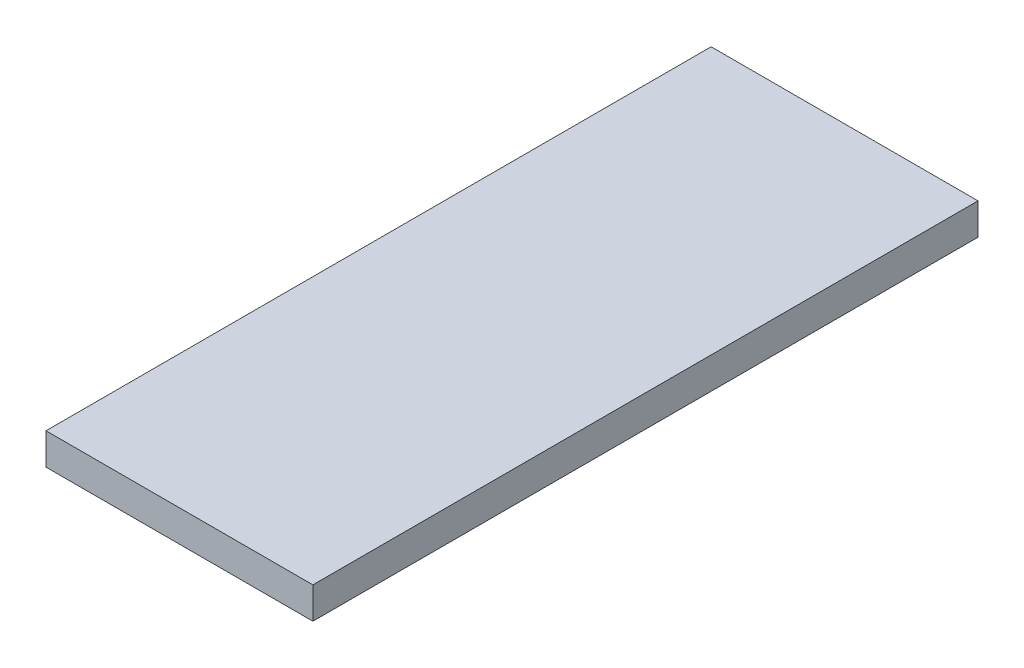
ISO-10303-21;
HEADER;
FILE_DESCRIPTION(('STEP AP214'),'2;1');
FILE_NAME('part.step','',(''),(''),'','','');
FILE_SCHEMA(('AUTOMOTIVE_DESIGN { 1 0 10303 214 1 1 1 1 }'));
ENDSEC;
DATA;
#1=APPLICATION_CONTEXT('core data for automotive mechanical design processes');
#2=APPLICATION_PROTOCOL_DEFINITION('international standard','automotive_design',2000,#1);
#3=PRODUCT_CONTEXT('',#1,'mechanical');
#4=PRODUCT('Part','Part','',(#3));
#5=PRODUCT_RELATED_PRODUCT_CATEGORY('part','',(#4));
#6=PRODUCT_DEFINITION_FORMATION('','',#4);
#7=PRODUCT_DEFINITION_CONTEXT('part definition',#1,'design');
#8=PRODUCT_DEFINITION('design','',#6,#7);
#9=PRODUCT_DEFINITION_SHAPE('','',#8);
#10=(LENGTH_UNIT() NAMED_UNIT(*) SI_UNIT(.MILLI.,.METRE.));
#11=(NAMED_UNIT(*) PLANE_ANGLE_UNIT() SI_UNIT($,.RADIAN.));
#12=(NAMED_UNIT(*) SI_UNIT($,.STERADIAN.) SOLID_ANGLE_UNIT());
#13=UNCERTAINTY_MEASURE_WITH_UNIT(LENGTH_MEASURE(1.E-05),#10,'distance_accuracy_value','');
#14=(GEOMETRIC_REPRESENTATION_CONTEXT(3) GLOBAL_UNCERTAINTY_ASSIGNED_CONTEXT((#13)) GLOBAL_UNIT_ASSIGNED_CONTEXT((#10,
#11,#12)) REPRESENTATION_CONTEXT('',''));
#15=CARTESIAN_POINT('',(0.,0.,0.));
#16=DIRECTION('',(0.,0.,1.));
#17=DIRECTION('',(1.,0.,0.));
#18=AXIS2_PLACEMENT_3D('',#15,#16,#17);
#19=CARTESIAN_POINT('',(12.7,3.,-31.6499999999998));
#20=DIRECTION('',(-1.,0.,0.));
#21=DIRECTION('',(0.,0.,1.));
#22=AXIS2_PLACEMENT_3D('',#19,#20,#21);
#23=PLANE('',#22);
#24=DIRECTION('',(0.,0.,-1.));
#25=VECTOR('',#24,1.);
#26=CARTESIAN_POINT('',(12.7,0.,-31.6499999999998));
#27=LINE('',#26,#25);
#28=CARTESIAN_POINT('',(12.7,0.,31.6500000000002));
#29=VERTEX_POINT('',#28);
#30=CARTESIAN_POINT('',(12.7,0.,-31.6499999999998));
#31=VERTEX_POINT('',#30);
#32=EDGE_CURVE('E113',#29,#31,#27,.T.);
#33=ORIENTED_EDGE('',*,*,#32,.T.);
#34=DIRECTION('',(0.,-1.,0.));
#35=VECTOR('',#34,1.);
#36=CARTESIAN_POINT('',(12.7,3.,-31.6499999999998));
#37=LINE('',#36,#35);
#38=CARTESIAN_POINT('',(12.7,3.,-31.6499999999998));
#39=VERTEX_POINT('',#38);
#40=EDGE_CURVE('E11',#39,#31,#37,.T.);
#41=ORIENTED_EDGE('',*,*,#40,.F.);
#42=DIRECTION('',(0.,0.,-1.));
#43=VECTOR('',#42,1.);
#44=CARTESIAN_POINT('',(12.7,3.,-31.6499999999998));
#45=LINE('',#44,#43);
#46=CARTESIAN_POINT('',(12.7,3.,31.6500000000002));
#47=VERTEX_POINT('',#46);
#48=EDGE_CURVE('E97',#47,#39,#45,.T.);
#49=ORIENTED_EDGE('',*,*,#48,.F.);
#50=DIRECTION('',(0.,-1.,0.));
#51=VECTOR('',#50,1.);
#52=CARTESIAN_POINT('',(12.7,3.,31.6500000000002));
#53=LINE('',#52,#51);
#54=EDGE_CURVE('E109',#47,#29,#53,.T.);
#55=ORIENTED_EDGE('',*,*,#54,.T.);
#56=EDGE_LOOP('',(#33,#41,#49,#55));
#57=FACE_BOUND('',#56,.T.);
#58=ADVANCED_FACE('F45',(#57),#23,.F.);
#59=CARTESIAN_POINT('',(-12.6999999999999,3.,-31.6499999999998));
#60=DIRECTION('',(0.,0.,1.));
#61=DIRECTION('',(1.,0.,0.));
#62=AXIS2_PLACEMENT_3D('',#59,#60,#61);
#63=PLANE('',#62);
#64=DIRECTION('',(-1.,0.,0.));
#65=VECTOR('',#64,1.);
#66=CARTESIAN_POINT('',(-12.6999999999999,0.,-31.6499999999998));
#67=LINE('',#66,#65);
#68=CARTESIAN_POINT('',(-12.6999999999999,0.,-31.6499999999998));
#69=VERTEX_POINT('',#68);
#70=EDGE_CURVE('E102',#31,#69,#67,.T.);
#71=ORIENTED_EDGE('',*,*,#70,.T.);
#72=DIRECTION('',(0.,-1.,0.));
#73=VECTOR('',#72,1.);
#74=CARTESIAN_POINT('',(-12.6999999999999,3.,-31.6499999999998));
#75=LINE('',#74,#73);
#76=CARTESIAN_POINT('',(-12.6999999999999,3.,-31.6499999999998));
#77=VERTEX_POINT('',#76);
#78=EDGE_CURVE('E54',#77,#69,#75,.T.);
#79=ORIENTED_EDGE('',*,*,#78,.F.);
#80=DIRECTION('',(-1.,0.,0.));
#81=VECTOR('',#80,1.);
#82=CARTESIAN_POINT('',(-12.6999999999999,3.,-31.6499999999998));
#83=LINE('',#82,#81);
#84=EDGE_CURVE('E92',#39,#77,#83,.T.);
#85=ORIENTED_EDGE('',*,*,#84,.F.);
#86=ORIENTED_EDGE('',*,*,#40,.T.);
#87=EDGE_LOOP('',(#71,#79,#85,#86));
#88=FACE_BOUND('',#87,.T.);
#89=ADVANCED_FACE('F101',(#88),#63,.F.);
#90=CARTESIAN_POINT('',(-12.6999999999999,3.,-31.6499999999998));
#91=DIRECTION('',(1.,0.,0.));
#92=DIRECTION('',(0.,0.,-1.));
#93=AXIS2_PLACEMENT_3D('',#90,#91,#92);
#94=PLANE('',#93);
#95=DIRECTION('',(0.,0.,1.));
#96=VECTOR('',#95,1.);
#97=CARTESIAN_POINT('',(-12.6999999999999,0.,-31.6499999999998));
#98=LINE('',#97,#96);
#99=CARTESIAN_POINT('',(-12.7,0.,31.6500000000002));
#100=VERTEX_POINT('',#99);
#101=EDGE_CURVE('E79',#69,#100,#98,.T.);
#102=ORIENTED_EDGE('',*,*,#101,.T.);
#103=DIRECTION('',(0.,-1.,0.));
#104=VECTOR('',#103,1.);
#105=CARTESIAN_POINT('',(-12.7,3.,31.6500000000002));
#106=LINE('',#105,#104);
#107=CARTESIAN_POINT('',(-12.7,3.,31.6500000000002));
#108=VERTEX_POINT('',#107);
#109=EDGE_CURVE('E104',#108,#100,#106,.T.);
#110=ORIENTED_EDGE('',*,*,#109,.F.);
#111=DIRECTION('',(0.,0.,1.));
#112=VECTOR('',#111,1.);
#113=CARTESIAN_POINT('',(-12.6999999999999,3.,-31.6499999999998));
#114=LINE('',#113,#112);
#115=EDGE_CURVE('E95',#77,#108,#114,.T.);
#116=ORIENTED_EDGE('',*,*,#115,.F.);
#117=ORIENTED_EDGE('',*,*,#78,.T.);
#118=EDGE_LOOP('',(#102,#110,#116,#117));
#119=FACE_BOUND('',#118,.T.);
#120=ADVANCED_FACE('F105',(#119),#94,.F.);
#121=CARTESIAN_POINT('',(-12.7,3.,31.6500000000002));
#122=DIRECTION('',(0.,0.,-1.));
#123=DIRECTION('',(-1.,0.,0.));
#124=AXIS2_PLACEMENT_3D('',#121,#122,#123);
#125=PLANE('',#124);
#126=DIRECTION('',(1.,0.,0.));
#127=VECTOR('',#126,1.);
#128=CARTESIAN_POINT('',(-12.7,0.,31.6500000000002));
#129=LINE('',#128,#127);
#130=EDGE_CURVE('E85',#100,#29,#129,.T.);
#131=ORIENTED_EDGE('',*,*,#130,.T.);
#132=ORIENTED_EDGE('',*,*,#54,.F.);
#133=DIRECTION('',(1.,0.,0.));
#134=VECTOR('',#133,1.);
#135=CARTESIAN_POINT('',(-12.7,3.,31.6500000000002));
#136=LINE('',#135,#134);
#137=EDGE_CURVE('E62',#108,#47,#136,.T.);
#138=ORIENTED_EDGE('',*,*,#137,.F.);
#139=ORIENTED_EDGE('',*,*,#109,.T.);
#140=EDGE_LOOP('',(#131,#132,#138,#139));
#141=FACE_BOUND('',#140,.T.);
#142=ADVANCED_FACE('F126',(#141),#125,.F.);
#143=CARTESIAN_POINT('',(0.,3.,0.));
#144=DIRECTION('',(0.,1.,0.));
#145=DIRECTION('',(0.,0.,1.));
#146=AXIS2_PLACEMENT_3D('',#143,#144,#145);
#147=PLANE('',#146);
#148=ORIENTED_EDGE('',*,*,#48,.T.);
#149=ORIENTED_EDGE('',*,*,#84,.T.);
#150=ORIENTED_EDGE('',*,*,#115,.T.);
#151=ORIENTED_EDGE('',*,*,#137,.T.);
#152=EDGE_LOOP('',(#148,#149,#150,#151));
#153=FACE_BOUND('',#152,.T.);
#154=ADVANCED_FACE('F93',(#153),#147,.T.);
#155=CARTESIAN_POINT('',(0.,0.,0.));
#156=DIRECTION('',(0.,1.,0.));
#157=DIRECTION('',(0.,0.,1.));
#158=AXIS2_PLACEMENT_3D('',#155,#156,#157);
#159=PLANE('',#158);
#160=ORIENTED_EDGE('',*,*,#32,.F.);
#161=ORIENTED_EDGE('',*,*,#130,.F.);
#162=ORIENTED_EDGE('',*,*,#101,.F.);
#163=ORIENTED_EDGE('',*,*,#70,.F.);
#164=EDGE_LOOP('',(#160,#161,#162,#163));
#165=FACE_BOUND('',#164,.T.);
#166=ADVANCED_FACE('F129',(#165),#159,.F.);
#167=CLOSED_SHELL('',(#58,#89,#120,#142,#154,#166));
#168=MANIFOLD_SOLID_BREP('B2',#167);
#169=ADVANCED_BREP_SHAPE_REPRESENTATION('',(#18,#168),#14);
#170=SHAPE_DEFINITION_REPRESENTATION(#9,#169);
ENDSEC;
END-ISO-10303-21;
